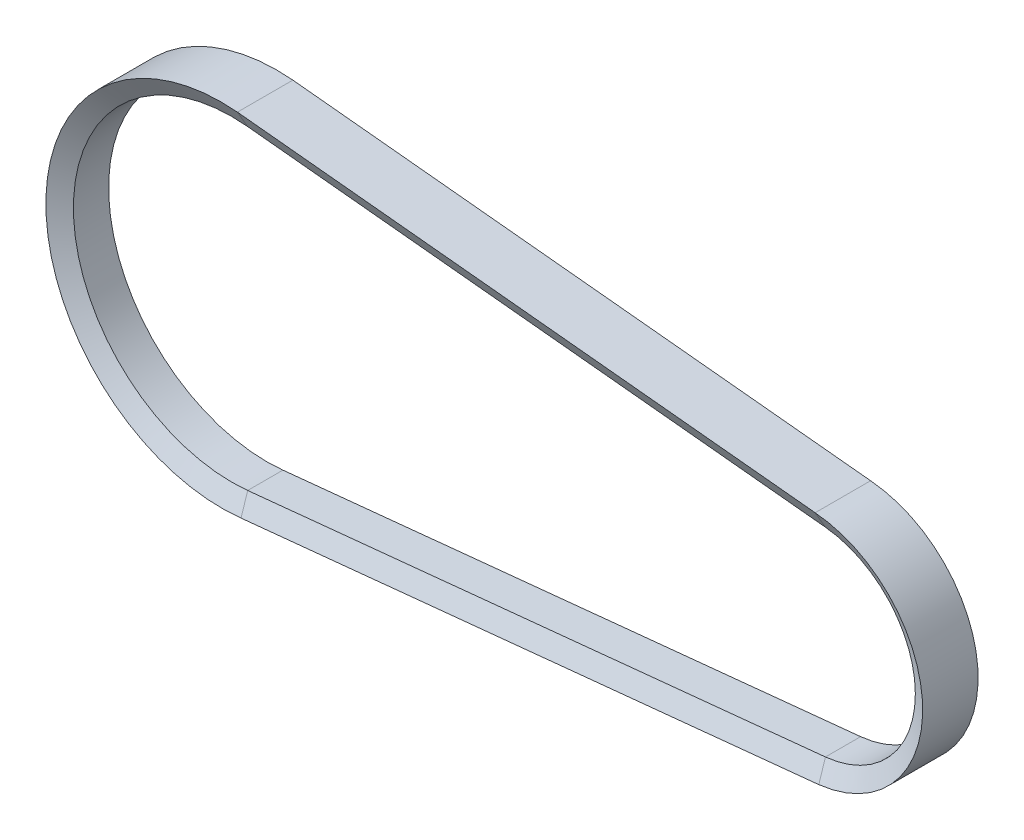
ISO-10303-21;
HEADER;
FILE_DESCRIPTION(('STEP AP214'),'2;1');
FILE_NAME('part.step','',(''),(''),'','','');
FILE_SCHEMA(('AUTOMOTIVE_DESIGN { 1 0 10303 214 1 1 1 1 }'));
ENDSEC;
DATA;
#1=APPLICATION_CONTEXT('core data for automotive mechanical design processes');
#2=APPLICATION_PROTOCOL_DEFINITION('international standard','automotive_design',2000,#1);
#3=PRODUCT_CONTEXT('',#1,'mechanical');
#4=PRODUCT('Part','Part','',(#3));
#5=PRODUCT_RELATED_PRODUCT_CATEGORY('part','',(#4));
#6=PRODUCT_DEFINITION_FORMATION('','',#4);
#7=PRODUCT_DEFINITION_CONTEXT('part definition',#1,'design');
#8=PRODUCT_DEFINITION('design','',#6,#7);
#9=PRODUCT_DEFINITION_SHAPE('','',#8);
#10=(LENGTH_UNIT() NAMED_UNIT(*) SI_UNIT(.MILLI.,.METRE.));
#11=(NAMED_UNIT(*) PLANE_ANGLE_UNIT() SI_UNIT($,.RADIAN.));
#12=(NAMED_UNIT(*) SI_UNIT($,.STERADIAN.) SOLID_ANGLE_UNIT());
#13=UNCERTAINTY_MEASURE_WITH_UNIT(LENGTH_MEASURE(1.E-05),#10,'distance_accuracy_value','');
#14=(GEOMETRIC_REPRESENTATION_CONTEXT(3) GLOBAL_UNCERTAINTY_ASSIGNED_CONTEXT((#13)) GLOBAL_UNIT_ASSIGNED_CONTEXT((#10,
#11,#12)) REPRESENTATION_CONTEXT('',''));
#15=CARTESIAN_POINT('',(0.,0.,0.));
#16=DIRECTION('',(0.,0.,1.));
#17=DIRECTION('',(1.,0.,0.));
#18=AXIS2_PLACEMENT_3D('',#15,#16,#17);
#19=CARTESIAN_POINT('',(203.4,40.1002512578676,9.49910161513779));
#20=DIRECTION('',(0.05018856132285,0.499369880026909,-0.864934003976172));
#21=DIRECTION('',(0.,0.866025403784436,0.500000000000004));
#22=AXIS2_PLACEMENT_3D('',#19,#20,#21);
#23=PLANE('',#22);
#24=DIRECTION('',(0.,-0.866025403784436,-0.500000000000004));
#25=VECTOR('',#24,1.);
#26=CARTESIAN_POINT('',(203.4,40.1002512578676,9.49910161513779));
#27=LINE('',#26,#25);
#28=CARTESIAN_POINT('',(203.4,40.1002512578676,9.49910161513779));
#29=VERTEX_POINT('',#28);
#30=CARTESIAN_POINT('',(203.4,34.1002512578676,6.035));
#31=VERTEX_POINT('',#30);
#32=EDGE_CURVE('E152',#29,#31,#27,.T.);
#33=ORIENTED_EDGE('',*,*,#32,.F.);
#34=DIRECTION('',(-0.99498743710662,0.1,0.));
#35=VECTOR('',#34,1.);
#36=CARTESIAN_POINT('',(203.4,40.1002512578676,9.49910161513779));
#37=LINE('',#36,#35);
#38=CARTESIAN_POINT('',(5.4,60.,9.49910161513779));
#39=VERTEX_POINT('',#38);
#40=EDGE_CURVE('E151',#29,#39,#37,.T.);
#41=ORIENTED_EDGE('',*,*,#40,.T.);
#42=DIRECTION('',(0.,-0.866025403784436,-0.500000000000004));
#43=VECTOR('',#42,1.);
#44=CARTESIAN_POINT('',(5.4,60.,9.49910161513779));
#45=LINE('',#44,#43);
#46=CARTESIAN_POINT('',(5.4,54.,6.035));
#47=VERTEX_POINT('',#46);
#48=EDGE_CURVE('E130',#39,#47,#45,.T.);
#49=ORIENTED_EDGE('',*,*,#48,.T.);
#50=DIRECTION('',(-0.99498743710662,0.1,0.));
#51=VECTOR('',#50,1.);
#52=CARTESIAN_POINT('',(203.4,34.1002512578676,6.035));
#53=LINE('',#52,#51);
#54=EDGE_CURVE('E156',#31,#47,#53,.T.);
#55=ORIENTED_EDGE('',*,*,#54,.F.);
#56=EDGE_LOOP('',(#33,#41,#49,#55));
#57=FACE_BOUND('',#56,.T.);
#58=ADVANCED_FACE('F36',(#57),#23,.F.);
#59=CARTESIAN_POINT('',(5.4,60.,9.49910161513779));
#60=CARTESIAN_POINT('',(-32.605138259558,63.4204624433602,9.49910161513779));
#61=CARTESIAN_POINT('',(-60.6364428921146,37.5296135184722,9.49910161513779));
#62=CARTESIAN_POINT('',(-60.2392462263972,-0.627067839624252,9.49910161513779));
#63=CARTESIAN_POINT('',(-59.8420495606798,-38.7837491977207,9.49910161513779));
#64=CARTESIAN_POINT('',(-31.2778496811351,-64.0854602603342,9.49910161513779));
#65=CARTESIAN_POINT('',(6.64784924527944,-59.8745864320751,9.49910161513779));
#66=CARTESIAN_POINT('',(5.4,54.,6.035));
#67=CARTESIAN_POINT('',(-28.8046244336022,57.4204624433602,6.035));
#68=CARTESIAN_POINT('',(-54.2864668868793,34.3481500070961,6.035));
#69=CARTESIAN_POINT('',(-54.2693216037575,-0.0270678396242525,6.035));
#70=CARTESIAN_POINT('',(-54.2521763206357,-34.4022856863446,6.035));
#71=CARTESIAN_POINT('',(-28.7473310562264,-57.449167558059,6.035));
#72=CARTESIAN_POINT('',(5.45386432075149,-53.9945864320751,6.035));
#73=(BOUNDED_SURFACE() B_SPLINE_SURFACE(1,3,((#59,#60,#61,#62,#63,#64,#65),(#66,#67,#68,#69,#70,
#71,#72)),.UNSPECIFIED.,.F.,.F.,.F.) B_SPLINE_SURFACE_WITH_KNOTS((2,2),(4,3,4),(0.,1.),(0.,0.5,
1.),.UNSPECIFIED.) GEOMETRIC_REPRESENTATION_ITEM() RATIONAL_B_SPLINE_SURFACE(((1.,
0.780546928833291,0.780546928833291,1.,0.780546928833291,0.780546928833291,1.),(1.,
0.780546928833291,0.780546928833291,1.,0.780546928833291,0.780546928833291,1.))) REPRESENTATION_ITEM('') SURFACE());
#74=CARTESIAN_POINT('',(0.,0.,6.035));
#75=DIRECTION('',(0.,0.,1.));
#76=DIRECTION('',(0.0995037190209989,0.995037190209989,0.));
#77=AXIS2_PLACEMENT_3D('',#74,#75,#76);
#78=CIRCLE('',#77,54.2693283540528);
#79=CARTESIAN_POINT('',(5.45386432075149,-53.9945864320752,6.035));
#80=VERTEX_POINT('',#79);
#81=EDGE_CURVE('E120',#47,#80,#78,.T.);
#82=CARTESIAN_POINT('',(0.,0.,9.49910161513779));
#83=DIRECTION('',(0.,0.,1.));
#84=DIRECTION('',(0.0896376994958906,0.995974438843229,0.));
#85=AXIS2_PLACEMENT_3D('',#82,#83,#84);
#86=CIRCLE('',#85,60.2425099078715);
#87=CARTESIAN_POINT('',(6.64784924527943,-59.8745864320751,9.49910161513779));
#88=VERTEX_POINT('',#87);
#89=EDGE_CURVE('E133',#39,#88,#86,.T.);
#90=DIRECTION('',(-0.17233687939614,0.848704895708748,-0.500000000000004));
#91=VECTOR('',#90,1.);
#92=CARTESIAN_POINT('',(6.64784924527944,-59.8745864320751,9.49910161513779));
#93=LINE('',#92,#91);
#94=EDGE_CURVE('E148',#88,#80,#93,.T.);
#95=ORIENTED_EDGE('',*,*,#81,.F.);
#96=ORIENTED_EDGE('',*,*,#48,.F.);
#97=ORIENTED_EDGE('',*,*,#89,.T.);
#98=ORIENTED_EDGE('',*,*,#94,.T.);
#99=EDGE_LOOP('',(#95,#96,#97,#98));
#100=FACE_BOUND('',#99,.T.);
#101=ADVANCED_FACE('F132',(#100),#73,.F.);
#102=CARTESIAN_POINT('',(0.,0.,0.));
#103=DIRECTION('',(0.,0.,1.));
#104=DIRECTION('',(1.,0.,0.));
#105=AXIS2_PLACEMENT_3D('',#102,#103,#104);
#106=CYLINDRICAL_SURFACE('',#105,54.2693283540528);
#107=CARTESIAN_POINT('',(0.,0.,-6.035));
#108=DIRECTION('',(0.,0.,1.));
#109=DIRECTION('',(0.0995037190209989,0.995037190209989,0.));
#110=AXIS2_PLACEMENT_3D('',#107,#108,#109);
#111=CIRCLE('',#110,54.2693283540528);
#112=CARTESIAN_POINT('',(5.4,54.,-6.035));
#113=VERTEX_POINT('',#112);
#114=CARTESIAN_POINT('',(5.45386432075149,-53.9945864320752,-6.035));
#115=VERTEX_POINT('',#114);
#116=EDGE_CURVE('E114',#113,#115,#111,.T.);
#117=ORIENTED_EDGE('',*,*,#116,.F.);
#118=DIRECTION('',(0.,0.,-1.));
#119=VECTOR('',#118,1.);
#120=CARTESIAN_POINT('',(5.4,54.,6.035));
#121=LINE('',#120,#119);
#122=EDGE_CURVE('E138',#47,#113,#121,.T.);
#123=ORIENTED_EDGE('',*,*,#122,.F.);
#124=ORIENTED_EDGE('',*,*,#81,.T.);
#125=DIRECTION('',(0.,0.,-1.));
#126=VECTOR('',#125,1.);
#127=CARTESIAN_POINT('',(5.4538643207515,-53.9945864320752,6.035));
#128=LINE('',#127,#126);
#129=EDGE_CURVE('E189',#80,#115,#128,.T.);
#130=ORIENTED_EDGE('',*,*,#129,.T.);
#131=EDGE_LOOP('',(#117,#123,#124,#130));
#132=FACE_BOUND('',#131,.T.);
#133=ADVANCED_FACE('F215',(#132),#106,.F.);
#134=CARTESIAN_POINT('',(5.4,54.,-6.035));
#135=CARTESIAN_POINT('',(-28.8046244336022,57.4204624433602,-6.035));
#136=CARTESIAN_POINT('',(-54.2864668868793,34.3481500070961,-6.035));
#137=CARTESIAN_POINT('',(-54.2693216037575,-0.0270678396242525,-6.035));
#138=CARTESIAN_POINT('',(-54.2521763206357,-34.4022856863446,-6.035));
#139=CARTESIAN_POINT('',(-28.7473310562264,-57.449167558059,-6.035));
#140=CARTESIAN_POINT('',(5.45386432075149,-53.9945864320751,-6.035));
#141=CARTESIAN_POINT('',(5.4,60.,-9.49910161513779));
#142=CARTESIAN_POINT('',(-32.605138259558,63.4204624433602,-9.49910161513779));
#143=CARTESIAN_POINT('',(-60.6364428921146,37.5296135184722,-9.49910161513779));
#144=CARTESIAN_POINT('',(-60.2392462263972,-0.627067839624252,-9.49910161513779));
#145=CARTESIAN_POINT('',(-59.8420495606798,-38.7837491977207,-9.49910161513779));
#146=CARTESIAN_POINT('',(-31.2778496811351,-64.0854602603342,-9.49910161513779));
#147=CARTESIAN_POINT('',(6.64784924527944,-59.8745864320751,-9.49910161513779));
#148=(BOUNDED_SURFACE() B_SPLINE_SURFACE(1,3,((#134,#135,#136,#137,#138,#139,#140),(#141,#142,
#143,#144,#145,#146,#147)),.UNSPECIFIED.,.F.,.F.,.F.) B_SPLINE_SURFACE_WITH_KNOTS((2,2),(4,3,4),
(0.,1.),(0.,0.5,1.),
.UNSPECIFIED.) GEOMETRIC_REPRESENTATION_ITEM() RATIONAL_B_SPLINE_SURFACE(((1.,0.780546928833291,
0.780546928833291,1.,0.780546928833291,0.780546928833291,1.),(1.,0.780546928833291,
0.780546928833291,1.,0.780546928833291,0.780546928833291,1.))) REPRESENTATION_ITEM('') SURFACE());
#149=CARTESIAN_POINT('',(0.,0.,-9.49910161513779));
#150=DIRECTION('',(0.,0.,1.));
#151=DIRECTION('',(0.0896376994958906,0.995974438843229,0.));
#152=AXIS2_PLACEMENT_3D('',#149,#150,#151);
#153=CIRCLE('',#152,60.2425099078715);
#154=CARTESIAN_POINT('',(5.4,60.,-9.49910161513779));
#155=VERTEX_POINT('',#154);
#156=CARTESIAN_POINT('',(6.64784924527943,-59.8745864320751,-9.49910161513779));
#157=VERTEX_POINT('',#156);
#158=EDGE_CURVE('E166',#155,#157,#153,.T.);
#159=DIRECTION('',(0.,0.866025403784436,-0.500000000000004));
#160=VECTOR('',#159,1.);
#161=CARTESIAN_POINT('',(5.4,54.,-6.035));
#162=LINE('',#161,#160);
#163=EDGE_CURVE('E159',#113,#155,#162,.T.);
#164=DIRECTION('',(0.17233687939614,-0.848704895708748,-0.500000000000004));
#165=VECTOR('',#164,1.);
#166=CARTESIAN_POINT('',(5.4538643207515,-53.9945864320752,-6.035));
#167=LINE('',#166,#165);
#168=EDGE_CURVE('E188',#115,#157,#167,.T.);
#169=ORIENTED_EDGE('',*,*,#158,.F.);
#170=ORIENTED_EDGE('',*,*,#163,.F.);
#171=ORIENTED_EDGE('',*,*,#116,.T.);
#172=ORIENTED_EDGE('',*,*,#168,.T.);
#173=EDGE_LOOP('',(#169,#170,#171,#172));
#174=FACE_BOUND('',#173,.T.);
#175=ADVANCED_FACE('F187',(#174),#148,.F.);
#176=CARTESIAN_POINT('',(0.,0.,0.));
#177=DIRECTION('',(0.,0.,1.));
#178=DIRECTION('',(1.,0.,0.));
#179=AXIS2_PLACEMENT_3D('',#176,#177,#178);
#180=CYLINDRICAL_SURFACE('',#179,60.2425099078715);
#181=DIRECTION('',(0.,0.,1.));
#182=VECTOR('',#181,1.);
#183=CARTESIAN_POINT('',(6.64784924527944,-59.8745864320751,-9.49910161513779));
#184=LINE('',#183,#182);
#185=EDGE_CURVE('E146',#157,#88,#184,.T.);
#186=ORIENTED_EDGE('',*,*,#185,.T.);
#187=ORIENTED_EDGE('',*,*,#89,.F.);
#188=DIRECTION('',(0.,0.,1.));
#189=VECTOR('',#188,1.);
#190=CARTESIAN_POINT('',(5.4,60.,-9.49910161513779));
#191=LINE('',#190,#189);
#192=EDGE_CURVE('E145',#155,#39,#191,.T.);
#193=ORIENTED_EDGE('',*,*,#192,.F.);
#194=ORIENTED_EDGE('',*,*,#158,.T.);
#195=EDGE_LOOP('',(#186,#187,#193,#194));
#196=FACE_BOUND('',#195,.T.);
#197=ADVANCED_FACE('F143',(#196),#180,.T.);
#198=CARTESIAN_POINT('',(6.64784924527945,-59.8745864320751,9.49910161513779));
#199=DIRECTION('',(0.05018856132285,-0.499369880026909,-0.864934003976172));
#200=DIRECTION('',(0.,0.866025403784436,-0.500000000000004));
#201=AXIS2_PLACEMENT_3D('',#198,#199,#200);
#202=PLANE('',#201);
#203=DIRECTION('',(0.99498743710662,0.1,0.));
#204=VECTOR('',#203,1.);
#205=CARTESIAN_POINT('',(5.4538643207515,-53.9945864320752,6.035));
#206=LINE('',#205,#204);
#207=CARTESIAN_POINT('',(203.453864320752,-34.0948376899428,6.035));
#208=VERTEX_POINT('',#207);
#209=EDGE_CURVE('E101',#80,#208,#206,.T.);
#210=ORIENTED_EDGE('',*,*,#209,.F.);
#211=ORIENTED_EDGE('',*,*,#94,.F.);
#212=DIRECTION('',(0.99498743710662,0.1,0.));
#213=VECTOR('',#212,1.);
#214=CARTESIAN_POINT('',(6.64784924527945,-59.8745864320751,9.49910161513779));
#215=LINE('',#214,#213);
#216=CARTESIAN_POINT('',(204.647849245279,-39.9748376899427,9.49910161513779));
#217=VERTEX_POINT('',#216);
#218=EDGE_CURVE('E165',#88,#217,#215,.T.);
#219=ORIENTED_EDGE('',*,*,#218,.T.);
#220=DIRECTION('',(-0.17233687939614,0.848704895708748,-0.500000000000004));
#221=VECTOR('',#220,1.);
#222=CARTESIAN_POINT('',(204.647849245279,-39.9748376899427,9.49910161513779));
#223=LINE('',#222,#221);
#224=EDGE_CURVE('E174',#217,#208,#223,.T.);
#225=ORIENTED_EDGE('',*,*,#224,.T.);
#226=EDGE_LOOP('',(#210,#211,#219,#225));
#227=FACE_BOUND('',#226,.T.);
#228=ADVANCED_FACE('F211',(#227),#202,.F.);
#229=CARTESIAN_POINT('',(5.4538643207515,-53.9945864320752,6.035));
#230=DIRECTION('',(0.1,-0.99498743710662,0.));
#231=DIRECTION('',(0.99498743710662,0.1,0.));
#232=AXIS2_PLACEMENT_3D('',#229,#230,#231);
#233=PLANE('',#232);
#234=DIRECTION('',(0.99498743710662,0.1,0.));
#235=VECTOR('',#234,1.);
#236=CARTESIAN_POINT('',(5.4538643207515,-53.9945864320752,-6.035));
#237=LINE('',#236,#235);
#238=CARTESIAN_POINT('',(203.453864320752,-34.0948376899428,-6.035));
#239=VERTEX_POINT('',#238);
#240=EDGE_CURVE('E94',#115,#239,#237,.T.);
#241=ORIENTED_EDGE('',*,*,#240,.F.);
#242=ORIENTED_EDGE('',*,*,#129,.F.);
#243=ORIENTED_EDGE('',*,*,#209,.T.);
#244=DIRECTION('',(0.,0.,-1.));
#245=VECTOR('',#244,1.);
#246=CARTESIAN_POINT('',(203.453864320752,-34.0948376899428,6.035));
#247=LINE('',#246,#245);
#248=EDGE_CURVE('E172',#208,#239,#247,.T.);
#249=ORIENTED_EDGE('',*,*,#248,.T.);
#250=EDGE_LOOP('',(#241,#242,#243,#249));
#251=FACE_BOUND('',#250,.T.);
#252=ADVANCED_FACE('F214',(#251),#233,.F.);
#253=CARTESIAN_POINT('',(5.4538643207515,-53.9945864320752,-6.035));
#254=DIRECTION('',(0.05018856132285,-0.499369880026909,0.864934003976172));
#255=DIRECTION('',(0.,-0.866025403784436,-0.500000000000004));
#256=AXIS2_PLACEMENT_3D('',#253,#254,#255);
#257=PLANE('',#256);
#258=DIRECTION('',(0.99498743710662,0.1,0.));
#259=VECTOR('',#258,1.);
#260=CARTESIAN_POINT('',(6.64784924527945,-59.8745864320751,-9.49910161513779));
#261=LINE('',#260,#259);
#262=CARTESIAN_POINT('',(204.647849245279,-39.9748376899427,-9.49910161513779));
#263=VERTEX_POINT('',#262);
#264=EDGE_CURVE('E85',#157,#263,#261,.T.);
#265=ORIENTED_EDGE('',*,*,#264,.F.);
#266=ORIENTED_EDGE('',*,*,#168,.F.);
#267=ORIENTED_EDGE('',*,*,#240,.T.);
#268=DIRECTION('',(0.17233687939614,-0.848704895708748,-0.500000000000004));
#269=VECTOR('',#268,1.);
#270=CARTESIAN_POINT('',(203.453864320752,-34.0948376899428,-6.035));
#271=LINE('',#270,#269);
#272=EDGE_CURVE('E169',#239,#263,#271,.T.);
#273=ORIENTED_EDGE('',*,*,#272,.T.);
#274=EDGE_LOOP('',(#265,#266,#267,#273));
#275=FACE_BOUND('',#274,.T.);
#276=ADVANCED_FACE('F233',(#275),#257,.F.);
#277=CARTESIAN_POINT('',(6.64784924527945,-59.8745864320751,-9.49910161513779));
#278=DIRECTION('',(-0.1,0.99498743710662,0.));
#279=DIRECTION('',(-0.99498743710662,-0.1,0.));
#280=AXIS2_PLACEMENT_3D('',#277,#278,#279);
#281=PLANE('',#280);
#282=DIRECTION('',(0.,0.,1.));
#283=VECTOR('',#282,1.);
#284=CARTESIAN_POINT('',(204.647849245279,-39.9748376899427,-9.49910161513779));
#285=LINE('',#284,#283);
#286=EDGE_CURVE('E167',#263,#217,#285,.T.);
#287=ORIENTED_EDGE('',*,*,#286,.T.);
#288=ORIENTED_EDGE('',*,*,#218,.F.);
#289=ORIENTED_EDGE('',*,*,#185,.F.);
#290=ORIENTED_EDGE('',*,*,#264,.T.);
#291=EDGE_LOOP('',(#287,#288,#289,#290));
#292=FACE_BOUND('',#291,.T.);
#293=ADVANCED_FACE('F225',(#292),#281,.F.);
#294=CARTESIAN_POINT('',(204.647849245279,-39.9748376899427,9.49910161513779));
#295=CARTESIAN_POINT('',(270.938618081728,-32.2672516755786,9.49910161513779));
#296=CARTESIAN_POINT('',(269.898743710662,34.4619891142633,9.49910161513779));
#297=CARTESIAN_POINT('',(203.4,40.1002512578676,9.49910161513779));
#298=CARTESIAN_POINT('',(203.453864320752,-34.0948376899427,6.035));
#299=CARTESIAN_POINT('',(259.993756273555,-28.3672516755786,6.035));
#300=CARTESIAN_POINT('',(259.948869339596,28.4619891142634,6.035));
#301=CARTESIAN_POINT('',(203.4,34.1002512578676,6.035));
#302=(BOUNDED_SURFACE() B_SPLINE_SURFACE(1,3,((#294,#295,#296,#297),(#298,#299,#300,#301)),
.UNSPECIFIED.,.F.,.F.,.F.) B_SPLINE_SURFACE_WITH_KNOTS((2,2),(4,4),(0.,1.),(0.,1.),
.UNSPECIFIED.) GEOMETRIC_REPRESENTATION_ITEM() RATIONAL_B_SPLINE_SURFACE(((1.,0.4,0.4,1.),(1.,
0.4,0.4,1.))) REPRESENTATION_ITEM('') SURFACE());
#303=CARTESIAN_POINT('',(200.,0.,6.035));
#304=DIRECTION('',(0.,0.,1.));
#305=DIRECTION('',(0.100785865658542,-0.994908141128345,0.));
#306=AXIS2_PLACEMENT_3D('',#303,#304,#305);
#307=CIRCLE('',#306,34.2693322936077);
#308=EDGE_CURVE('E196',#208,#31,#307,.T.);
#309=CARTESIAN_POINT('',(200.,0.,9.49910161513779));
#310=DIRECTION('',(0.,0.,1.));
#311=DIRECTION('',(0.11549135309703,-0.993308485496735,0.));
#312=AXIS2_PLACEMENT_3D('',#309,#310,#311);
#313=CIRCLE('',#312,40.2441318821031);
#314=EDGE_CURVE('E168',#217,#29,#313,.T.);
#315=ORIENTED_EDGE('',*,*,#308,.F.);
#316=ORIENTED_EDGE('',*,*,#224,.F.);
#317=ORIENTED_EDGE('',*,*,#314,.T.);
#318=ORIENTED_EDGE('',*,*,#32,.T.);
#319=EDGE_LOOP('',(#315,#316,#317,#318));
#320=FACE_BOUND('',#319,.T.);
#321=ADVANCED_FACE('F223',(#320),#302,.F.);
#322=CARTESIAN_POINT('',(200.,0.,0.));
#323=DIRECTION('',(0.,0.,1.));
#324=DIRECTION('',(1.,0.,0.));
#325=AXIS2_PLACEMENT_3D('',#322,#323,#324);
#326=CYLINDRICAL_SURFACE('',#325,34.2693322936077);
#327=CARTESIAN_POINT('',(200.,0.,-6.035));
#328=DIRECTION('',(0.,0.,1.));
#329=DIRECTION('',(0.100785865658542,-0.994908141128345,0.));
#330=AXIS2_PLACEMENT_3D('',#327,#328,#329);
#331=CIRCLE('',#330,34.2693322936077);
#332=CARTESIAN_POINT('',(203.4,34.1002512578676,-6.035));
#333=VERTEX_POINT('',#332);
#334=EDGE_CURVE('E61',#239,#333,#331,.T.);
#335=ORIENTED_EDGE('',*,*,#334,.F.);
#336=ORIENTED_EDGE('',*,*,#248,.F.);
#337=ORIENTED_EDGE('',*,*,#308,.T.);
#338=DIRECTION('',(0.,0.,-1.));
#339=VECTOR('',#338,1.);
#340=CARTESIAN_POINT('',(203.4,34.1002512578676,6.035));
#341=LINE('',#340,#339);
#342=EDGE_CURVE('E194',#31,#333,#341,.T.);
#343=ORIENTED_EDGE('',*,*,#342,.T.);
#344=EDGE_LOOP('',(#335,#336,#337,#343));
#345=FACE_BOUND('',#344,.T.);
#346=ADVANCED_FACE('F220',(#345),#326,.F.);
#347=CARTESIAN_POINT('',(203.453864320752,-34.0948376899427,-6.035));
#348=CARTESIAN_POINT('',(259.993756273555,-28.3672516755786,-6.035));
#349=CARTESIAN_POINT('',(259.948869339596,28.4619891142634,-6.035));
#350=CARTESIAN_POINT('',(203.4,34.1002512578676,-6.035));
#351=CARTESIAN_POINT('',(204.647849245279,-39.9748376899427,-9.49910161513779));
#352=CARTESIAN_POINT('',(270.938618081728,-32.2672516755786,-9.49910161513779));
#353=CARTESIAN_POINT('',(269.898743710662,34.4619891142633,-9.49910161513779));
#354=CARTESIAN_POINT('',(203.4,40.1002512578676,-9.49910161513779));
#355=(BOUNDED_SURFACE() B_SPLINE_SURFACE(1,3,((#347,#348,#349,#350),(#351,#352,#353,#354)),
.UNSPECIFIED.,.F.,.F.,.F.) B_SPLINE_SURFACE_WITH_KNOTS((2,2),(4,4),(0.,1.),(0.,1.),
.UNSPECIFIED.) GEOMETRIC_REPRESENTATION_ITEM() RATIONAL_B_SPLINE_SURFACE(((1.,0.4,0.4,1.),(1.,
0.4,0.4,1.))) REPRESENTATION_ITEM('') SURFACE());
#356=CARTESIAN_POINT('',(200.,0.,-9.49910161513779));
#357=DIRECTION('',(0.,0.,1.));
#358=DIRECTION('',(0.11549135309703,-0.993308485496735,0.));
#359=AXIS2_PLACEMENT_3D('',#356,#357,#358);
#360=CIRCLE('',#359,40.2441318821031);
#361=CARTESIAN_POINT('',(203.4,40.1002512578676,-9.49910161513779));
#362=VERTEX_POINT('',#361);
#363=EDGE_CURVE('E53',#263,#362,#360,.T.);
#364=DIRECTION('',(0.,0.866025403784436,-0.500000000000004));
#365=VECTOR('',#364,1.);
#366=CARTESIAN_POINT('',(203.4,34.1002512578676,-6.035));
#367=LINE('',#366,#365);
#368=EDGE_CURVE('E180',#333,#362,#367,.T.);
#369=ORIENTED_EDGE('',*,*,#363,.F.);
#370=ORIENTED_EDGE('',*,*,#272,.F.);
#371=ORIENTED_EDGE('',*,*,#334,.T.);
#372=ORIENTED_EDGE('',*,*,#368,.T.);
#373=EDGE_LOOP('',(#369,#370,#371,#372));
#374=FACE_BOUND('',#373,.T.);
#375=ADVANCED_FACE('F231',(#374),#355,.F.);
#376=CARTESIAN_POINT('',(200.,0.,0.));
#377=DIRECTION('',(0.,0.,1.));
#378=DIRECTION('',(1.,0.,0.));
#379=AXIS2_PLACEMENT_3D('',#376,#377,#378);
#380=CYLINDRICAL_SURFACE('',#379,40.2441318821031);
#381=DIRECTION('',(0.,0.,1.));
#382=VECTOR('',#381,1.);
#383=CARTESIAN_POINT('',(203.4,40.1002512578676,-9.49910161513779));
#384=LINE('',#383,#382);
#385=EDGE_CURVE('E40',#362,#29,#384,.T.);
#386=ORIENTED_EDGE('',*,*,#385,.T.);
#387=ORIENTED_EDGE('',*,*,#314,.F.);
#388=ORIENTED_EDGE('',*,*,#286,.F.);
#389=ORIENTED_EDGE('',*,*,#363,.T.);
#390=EDGE_LOOP('',(#386,#387,#388,#389));
#391=FACE_BOUND('',#390,.T.);
#392=ADVANCED_FACE('F181',(#391),#380,.T.);
#393=CARTESIAN_POINT('',(203.4,34.1002512578676,6.035));
#394=DIRECTION('',(0.1,0.99498743710662,0.));
#395=DIRECTION('',(-0.99498743710662,0.1,0.));
#396=AXIS2_PLACEMENT_3D('',#393,#394,#395);
#397=PLANE('',#396);
#398=ORIENTED_EDGE('',*,*,#54,.T.);
#399=ORIENTED_EDGE('',*,*,#122,.T.);
#400=DIRECTION('',(-0.99498743710662,0.1,0.));
#401=VECTOR('',#400,1.);
#402=CARTESIAN_POINT('',(203.4,34.1002512578676,-6.035));
#403=LINE('',#402,#401);
#404=EDGE_CURVE('E45',#333,#113,#403,.T.);
#405=ORIENTED_EDGE('',*,*,#404,.F.);
#406=ORIENTED_EDGE('',*,*,#342,.F.);
#407=EDGE_LOOP('',(#398,#399,#405,#406));
#408=FACE_BOUND('',#407,.T.);
#409=ADVANCED_FACE('F217',(#408),#397,.F.);
#410=CARTESIAN_POINT('',(203.4,34.1002512578676,-6.035));
#411=DIRECTION('',(0.05018856132285,0.499369880026909,0.864934003976172));
#412=DIRECTION('',(0.,-0.866025403784436,0.500000000000004));
#413=AXIS2_PLACEMENT_3D('',#410,#411,#412);
#414=PLANE('',#413);
#415=ORIENTED_EDGE('',*,*,#404,.T.);
#416=ORIENTED_EDGE('',*,*,#163,.T.);
#417=DIRECTION('',(-0.99498743710662,0.1,0.));
#418=VECTOR('',#417,1.);
#419=CARTESIAN_POINT('',(203.4,40.1002512578676,-9.49910161513779));
#420=LINE('',#419,#418);
#421=EDGE_CURVE('E11',#362,#155,#420,.T.);
#422=ORIENTED_EDGE('',*,*,#421,.F.);
#423=ORIENTED_EDGE('',*,*,#368,.F.);
#424=EDGE_LOOP('',(#415,#416,#422,#423));
#425=FACE_BOUND('',#424,.T.);
#426=ADVANCED_FACE('F185',(#425),#414,.F.);
#427=CARTESIAN_POINT('',(203.4,40.1002512578676,-9.49910161513779));
#428=DIRECTION('',(-0.1,-0.99498743710662,0.));
#429=DIRECTION('',(0.99498743710662,-0.1,0.));
#430=AXIS2_PLACEMENT_3D('',#427,#428,#429);
#431=PLANE('',#430);
#432=ORIENTED_EDGE('',*,*,#421,.T.);
#433=ORIENTED_EDGE('',*,*,#192,.T.);
#434=ORIENTED_EDGE('',*,*,#40,.F.);
#435=ORIENTED_EDGE('',*,*,#385,.F.);
#436=EDGE_LOOP('',(#432,#433,#434,#435));
#437=FACE_BOUND('',#436,.T.);
#438=ADVANCED_FACE('F38',(#437),#431,.F.);
#439=CLOSED_SHELL('',(#58,#101,#133,#175,#197,#228,#252,#276,#293,#321,#346,#375,#392,#409,#426,#438));
#440=MANIFOLD_SOLID_BREP('B2',#439);
#441=ADVANCED_BREP_SHAPE_REPRESENTATION('',(#18,#440),#14);
#442=SHAPE_DEFINITION_REPRESENTATION(#9,#441);
ENDSEC;
END-ISO-10303-21;
